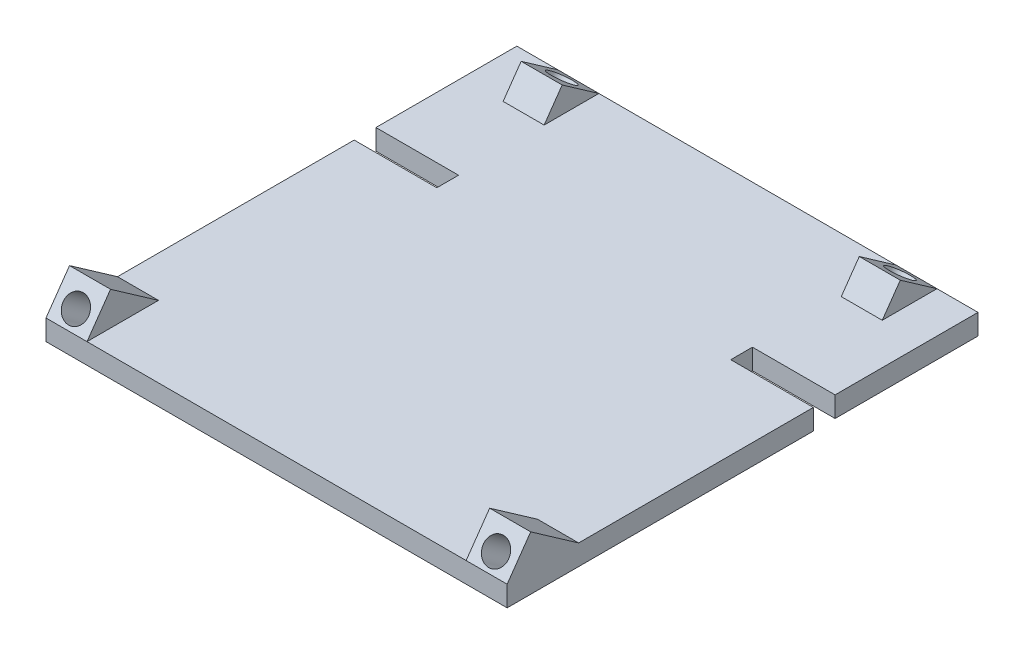
ISO-10303-21;
HEADER;
FILE_DESCRIPTION(('STEP AP214'),'2;1');
FILE_NAME('part.step','',(''),(''),'','','');
FILE_SCHEMA(('AUTOMOTIVE_DESIGN { 1 0 10303 214 1 1 1 1 }'));
ENDSEC;
DATA;
#1=APPLICATION_CONTEXT('core data for automotive mechanical design processes');
#2=APPLICATION_PROTOCOL_DEFINITION('international standard','automotive_design',2000,#1);
#3=PRODUCT_CONTEXT('',#1,'mechanical');
#4=PRODUCT('Part','Part','',(#3));
#5=PRODUCT_RELATED_PRODUCT_CATEGORY('part','',(#4));
#6=PRODUCT_DEFINITION_FORMATION('','',#4);
#7=PRODUCT_DEFINITION_CONTEXT('part definition',#1,'design');
#8=PRODUCT_DEFINITION('design','',#6,#7);
#9=PRODUCT_DEFINITION_SHAPE('','',#8);
#10=(LENGTH_UNIT() NAMED_UNIT(*) SI_UNIT(.MILLI.,.METRE.));
#11=(NAMED_UNIT(*) PLANE_ANGLE_UNIT() SI_UNIT($,.RADIAN.));
#12=(NAMED_UNIT(*) SI_UNIT($,.STERADIAN.) SOLID_ANGLE_UNIT());
#13=UNCERTAINTY_MEASURE_WITH_UNIT(LENGTH_MEASURE(1.E-05),#10,'distance_accuracy_value','');
#14=(GEOMETRIC_REPRESENTATION_CONTEXT(3) GLOBAL_UNCERTAINTY_ASSIGNED_CONTEXT((#13)) GLOBAL_UNIT_ASSIGNED_CONTEXT((#10,
#11,#12)) REPRESENTATION_CONTEXT('',''));
#15=CARTESIAN_POINT('',(0.,0.,0.));
#16=DIRECTION('',(0.,0.,1.));
#17=DIRECTION('',(1.,0.,0.));
#18=AXIS2_PLACEMENT_3D('',#15,#16,#17);
#19=CARTESIAN_POINT('',(0.,36.4517386998749,0.));
#20=DIRECTION('',(0.,-1.,0.));
#21=DIRECTION('',(0.,0.,-1.));
#22=AXIS2_PLACEMENT_3D('',#19,#20,#21);
#23=PLANE('',#22);
#24=DIRECTION('',(0.,0.,1.));
#25=VECTOR('',#24,1.);
#26=CARTESIAN_POINT('',(-80.2666243987654,36.4517386998749,7.48223474989885));
#27=LINE('',#26,#25);
#28=CARTESIAN_POINT('',(-80.2666243987654,36.4517386998749,7.48223474989885));
#29=VERTEX_POINT('',#28);
#30=CARTESIAN_POINT('',(-80.2666243987654,36.4517386998749,24.9167027061099));
#31=VERTEX_POINT('',#30);
#32=EDGE_CURVE('E259',#29,#31,#27,.T.);
#33=ORIENTED_EDGE('',*,*,#32,.T.);
#34=DIRECTION('',(-1.,0.,0.));
#35=VECTOR('',#34,1.);
#36=CARTESIAN_POINT('',(22.1879607597597,36.4517386998749,24.91670270611));
#37=LINE('',#36,#35);
#38=CARTESIAN_POINT('',(12.1879607597597,36.4517386998749,24.91670270611));
#39=VERTEX_POINT('',#38);
#40=EDGE_CURVE('E200',#39,#31,#37,.T.);
#41=ORIENTED_EDGE('',*,*,#40,.F.);
#42=DIRECTION('',(0.,0.,1.));
#43=VECTOR('',#42,1.);
#44=CARTESIAN_POINT('',(12.1879607597597,36.4517386998749,7.48223474989886));
#45=LINE('',#44,#43);
#46=CARTESIAN_POINT('',(12.1879607597597,36.4517386998749,7.48223474989886));
#47=VERTEX_POINT('',#46);
#48=EDGE_CURVE('E318',#47,#39,#45,.T.);
#49=ORIENTED_EDGE('',*,*,#48,.F.);
#50=DIRECTION('',(1.,0.,0.));
#51=VECTOR('',#50,1.);
#52=CARTESIAN_POINT('',(12.1879607597597,36.4517386998749,7.48223474989886));
#53=LINE('',#52,#51);
#54=CARTESIAN_POINT('',(22.1879607597597,36.4517386998749,7.48223474989886));
#55=VERTEX_POINT('',#54);
#56=EDGE_CURVE('E309',#47,#55,#53,.T.);
#57=ORIENTED_EDGE('',*,*,#56,.T.);
#58=DIRECTION('',(0.,0.,1.));
#59=VECTOR('',#58,1.);
#60=CARTESIAN_POINT('',(22.1879607597597,36.4517386998749,0.));
#61=LINE('',#60,#59);
#62=CARTESIAN_POINT('',(22.1879607597597,36.4517386998749,-49.757339729889));
#63=VERTEX_POINT('',#62);
#64=EDGE_CURVE('E408',#63,#55,#61,.T.);
#65=ORIENTED_EDGE('',*,*,#64,.F.);
#66=DIRECTION('',(-1.,0.,0.));
#67=VECTOR('',#66,1.);
#68=CARTESIAN_POINT('',(0.,36.4517386998749,-49.757339729889));
#69=LINE('',#68,#67);
#70=CARTESIAN_POINT('',(2.03796075975966,36.4517386998749,-49.757339729889));
#71=VERTEX_POINT('',#70);
#72=EDGE_CURVE('E405',#63,#71,#69,.T.);
#73=ORIENTED_EDGE('',*,*,#72,.T.);
#74=DIRECTION('',(0.,0.,-1.));
#75=VECTOR('',#74,1.);
#76=CARTESIAN_POINT('',(2.03796075975966,36.4517386998749,0.));
#77=LINE('',#76,#75);
#78=CARTESIAN_POINT('',(2.03796075975966,36.4517386998749,-55.057339729889));
#79=VERTEX_POINT('',#78);
#80=EDGE_CURVE('E409',#71,#79,#77,.T.);
#81=ORIENTED_EDGE('',*,*,#80,.T.);
#82=DIRECTION('',(1.,0.,0.));
#83=VECTOR('',#82,1.);
#84=CARTESIAN_POINT('',(0.,36.4517386998749,-55.057339729889));
#85=LINE('',#84,#83);
#86=CARTESIAN_POINT('',(22.1879607597597,36.4517386998749,-55.057339729889));
#87=VERTEX_POINT('',#86);
#88=EDGE_CURVE('E412',#79,#87,#85,.T.);
#89=ORIENTED_EDGE('',*,*,#88,.T.);
#90=CARTESIAN_POINT('',(22.1879607597597,36.4517386998749,-89.907339729889));
#91=VERTEX_POINT('',#90);
#92=EDGE_CURVE('E415',#91,#87,#61,.T.);
#93=ORIENTED_EDGE('',*,*,#92,.F.);
#94=DIRECTION('',(-1.,0.,0.));
#95=VECTOR('',#94,1.);
#96=CARTESIAN_POINT('',(0.,36.4517386998749,-89.907339729889));
#97=LINE('',#96,#95);
#98=CARTESIAN_POINT('',(12.1879607597597,36.4517386998749,-89.907339729889));
#99=VERTEX_POINT('',#98);
#100=EDGE_CURVE('E418',#91,#99,#97,.T.);
#101=ORIENTED_EDGE('',*,*,#100,.T.);
#102=DIRECTION('',(0.,0.,-1.));
#103=VECTOR('',#102,1.);
#104=CARTESIAN_POINT('',(12.1879607597597,36.4517386998749,-76.5596766921129));
#105=LINE('',#104,#103);
#106=CARTESIAN_POINT('',(12.1879607597597,36.4517386998749,-76.5596766921129));
#107=VERTEX_POINT('',#106);
#108=EDGE_CURVE('E49',#107,#99,#105,.T.);
#109=ORIENTED_EDGE('',*,*,#108,.F.);
#110=DIRECTION('',(-1.,0.,0.));
#111=VECTOR('',#110,1.);
#112=CARTESIAN_POINT('',(12.1879607597597,36.4517386998749,-76.5596766921129));
#113=LINE('',#112,#111);
#114=CARTESIAN_POINT('',(2.18796075975966,36.4517386998749,-76.5596766921129));
#115=VERTEX_POINT('',#114);
#116=EDGE_CURVE('E54',#107,#115,#113,.T.);
#117=ORIENTED_EDGE('',*,*,#116,.T.);
#118=DIRECTION('',(0.,0.,-1.));
#119=VECTOR('',#118,1.);
#120=CARTESIAN_POINT('',(2.18796075975966,36.4517386998749,-76.5596766921129));
#121=LINE('',#120,#119);
#122=CARTESIAN_POINT('',(2.18796075975966,36.4517386998749,-89.907339729889));
#123=VERTEX_POINT('',#122);
#124=EDGE_CURVE('E344',#115,#123,#121,.T.);
#125=ORIENTED_EDGE('',*,*,#124,.T.);
#126=CARTESIAN_POINT('',(-70.2666243987654,36.4517386998749,-89.907339729889));
#127=VERTEX_POINT('',#126);
#128=EDGE_CURVE('E420',#123,#127,#97,.T.);
#129=ORIENTED_EDGE('',*,*,#128,.T.);
#130=DIRECTION('',(0.,0.,-1.));
#131=VECTOR('',#130,1.);
#132=CARTESIAN_POINT('',(-70.2666243987654,36.4517386998749,-76.5596766921129));
#133=LINE('',#132,#131);
#134=CARTESIAN_POINT('',(-70.2666243987654,36.4517386998749,-76.5596766921129));
#135=VERTEX_POINT('',#134);
#136=EDGE_CURVE('E292',#135,#127,#133,.T.);
#137=ORIENTED_EDGE('',*,*,#136,.F.);
#138=DIRECTION('',(1.,0.,0.));
#139=VECTOR('',#138,1.);
#140=CARTESIAN_POINT('',(-80.2666243987654,36.4517386998749,-76.5596766921129));
#141=LINE('',#140,#139);
#142=CARTESIAN_POINT('',(-80.2666243987654,36.4517386998749,-76.5596766921129));
#143=VERTEX_POINT('',#142);
#144=EDGE_CURVE('E276',#143,#135,#141,.T.);
#145=ORIENTED_EDGE('',*,*,#144,.F.);
#146=DIRECTION('',(0.,0.,-1.));
#147=VECTOR('',#146,1.);
#148=CARTESIAN_POINT('',(-80.2666243987654,36.4517386998749,-76.5596766921129));
#149=LINE('',#148,#147);
#150=CARTESIAN_POINT('',(-80.2666243987654,36.4517386998749,-89.907339729889));
#151=VERTEX_POINT('',#150);
#152=EDGE_CURVE('E288',#143,#151,#149,.T.);
#153=ORIENTED_EDGE('',*,*,#152,.T.);
#154=CARTESIAN_POINT('',(-90.2666243987654,36.4517386998749,-89.907339729889));
#155=VERTEX_POINT('',#154);
#156=EDGE_CURVE('E421',#151,#155,#97,.T.);
#157=ORIENTED_EDGE('',*,*,#156,.T.);
#158=DIRECTION('',(0.,0.,1.));
#159=VECTOR('',#158,1.);
#160=CARTESIAN_POINT('',(-90.2666243987654,36.4517386998749,0.));
#161=LINE('',#160,#159);
#162=CARTESIAN_POINT('',(-90.2666243987654,36.4517386998749,-55.5341879171155));
#163=VERTEX_POINT('',#162);
#164=EDGE_CURVE('E422',#155,#163,#161,.T.);
#165=ORIENTED_EDGE('',*,*,#164,.T.);
#166=DIRECTION('',(1.,0.,0.));
#167=VECTOR('',#166,1.);
#168=CARTESIAN_POINT('',(0.,36.4517386998749,-55.5341879171155));
#169=LINE('',#168,#167);
#170=CARTESIAN_POINT('',(-70.1166243987654,36.4517386998749,-55.5341879171155));
#171=VERTEX_POINT('',#170);
#172=EDGE_CURVE('E425',#163,#171,#169,.T.);
#173=ORIENTED_EDGE('',*,*,#172,.T.);
#174=DIRECTION('',(0.,0.,1.));
#175=VECTOR('',#174,1.);
#176=CARTESIAN_POINT('',(-70.1166243987654,36.4517386998749,0.));
#177=LINE('',#176,#175);
#178=CARTESIAN_POINT('',(-70.1166243987654,36.4517386998749,-50.2341879171155));
#179=VERTEX_POINT('',#178);
#180=EDGE_CURVE('E385',#171,#179,#177,.T.);
#181=ORIENTED_EDGE('',*,*,#180,.T.);
#182=DIRECTION('',(-1.,0.,0.));
#183=VECTOR('',#182,1.);
#184=CARTESIAN_POINT('',(0.,36.4517386998749,-50.2341879171155));
#185=LINE('',#184,#183);
#186=CARTESIAN_POINT('',(-90.2666243987654,36.4517386998749,-50.2341879171155));
#187=VERTEX_POINT('',#186);
#188=EDGE_CURVE('E255',#179,#187,#185,.T.);
#189=ORIENTED_EDGE('',*,*,#188,.T.);
#190=CARTESIAN_POINT('',(-90.2666243987654,36.4517386998749,7.48223474989885));
#191=VERTEX_POINT('',#190);
#192=EDGE_CURVE('E247',#187,#191,#161,.T.);
#193=ORIENTED_EDGE('',*,*,#192,.T.);
#194=DIRECTION('',(-1.,0.,0.));
#195=VECTOR('',#194,1.);
#196=CARTESIAN_POINT('',(-80.2666243987654,36.4517386998749,7.48223474989885));
#197=LINE('',#196,#195);
#198=EDGE_CURVE('E253',#29,#191,#197,.T.);
#199=ORIENTED_EDGE('',*,*,#198,.F.);
#200=EDGE_LOOP('',(#33,#41,#49,#57,#65,#73,#81,#89,#93,#101,#109,#117,#125,#129,#137,#145,#153,
#157,#165,#173,#181,#189,#193,#199));
#201=FACE_BOUND('',#200,.T.);
#202=ADVANCED_FACE('F34',(#201),#23,.F.);
#203=CARTESIAN_POINT('',(0.,31.4517386998749,-50.2341879171155));
#204=DIRECTION('',(0.,0.,-1.));
#205=DIRECTION('',(-1.,0.,0.));
#206=AXIS2_PLACEMENT_3D('',#203,#204,#205);
#207=PLANE('',#206);
#208=ORIENTED_EDGE('',*,*,#188,.F.);
#209=DIRECTION('',(0.,1.,0.));
#210=VECTOR('',#209,1.);
#211=CARTESIAN_POINT('',(-70.1166243987654,31.4517386998749,-50.2341879171155));
#212=LINE('',#211,#210);
#213=CARTESIAN_POINT('',(-70.1166243987654,31.4517386998749,-50.2341879171155));
#214=VERTEX_POINT('',#213);
#215=EDGE_CURVE('E11',#214,#179,#212,.T.);
#216=ORIENTED_EDGE('',*,*,#215,.F.);
#217=DIRECTION('',(-1.,0.,0.));
#218=VECTOR('',#217,1.);
#219=CARTESIAN_POINT('',(0.,31.4517386998749,-50.2341879171155));
#220=LINE('',#219,#218);
#221=CARTESIAN_POINT('',(-90.2666243987654,31.4517386998749,-50.2341879171155));
#222=VERTEX_POINT('',#221);
#223=EDGE_CURVE('E244',#214,#222,#220,.T.);
#224=ORIENTED_EDGE('',*,*,#223,.T.);
#225=DIRECTION('',(0.,1.,0.));
#226=VECTOR('',#225,1.);
#227=CARTESIAN_POINT('',(-90.2666243987654,31.4517386998749,-50.2341879171155));
#228=LINE('',#227,#226);
#229=EDGE_CURVE('E219',#222,#187,#228,.T.);
#230=ORIENTED_EDGE('',*,*,#229,.T.);
#231=EDGE_LOOP('',(#208,#216,#224,#230));
#232=FACE_BOUND('',#231,.T.);
#233=ADVANCED_FACE('F36',(#232),#207,.T.);
#234=CARTESIAN_POINT('',(-70.1166243987654,31.4517386998749,0.));
#235=DIRECTION('',(-1.,0.,0.));
#236=DIRECTION('',(0.,0.,1.));
#237=AXIS2_PLACEMENT_3D('',#234,#235,#236);
#238=PLANE('',#237);
#239=ORIENTED_EDGE('',*,*,#180,.F.);
#240=DIRECTION('',(0.,1.,0.));
#241=VECTOR('',#240,1.);
#242=CARTESIAN_POINT('',(-70.1166243987654,31.4517386998749,-55.5341879171155));
#243=LINE('',#242,#241);
#244=CARTESIAN_POINT('',(-70.1166243987654,31.4517386998749,-55.5341879171155));
#245=VERTEX_POINT('',#244);
#246=EDGE_CURVE('E42',#245,#171,#243,.T.);
#247=ORIENTED_EDGE('',*,*,#246,.F.);
#248=DIRECTION('',(0.,0.,1.));
#249=VECTOR('',#248,1.);
#250=CARTESIAN_POINT('',(-70.1166243987654,31.4517386998749,0.));
#251=LINE('',#250,#249);
#252=EDGE_CURVE('E241',#245,#214,#251,.T.);
#253=ORIENTED_EDGE('',*,*,#252,.T.);
#254=ORIENTED_EDGE('',*,*,#215,.T.);
#255=EDGE_LOOP('',(#239,#247,#253,#254));
#256=FACE_BOUND('',#255,.T.);
#257=ADVANCED_FACE('F382',(#256),#238,.T.);
#258=CARTESIAN_POINT('',(0.,31.4517386998749,-55.5341879171155));
#259=DIRECTION('',(0.,0.,1.));
#260=DIRECTION('',(1.,0.,0.));
#261=AXIS2_PLACEMENT_3D('',#258,#259,#260);
#262=PLANE('',#261);
#263=ORIENTED_EDGE('',*,*,#172,.F.);
#264=DIRECTION('',(0.,1.,0.));
#265=VECTOR('',#264,1.);
#266=CARTESIAN_POINT('',(-90.2666243987654,31.4517386998749,-55.5341879171155));
#267=LINE('',#266,#265);
#268=CARTESIAN_POINT('',(-90.2666243987654,31.4517386998749,-55.5341879171155));
#269=VERTEX_POINT('',#268);
#270=EDGE_CURVE('E389',#269,#163,#267,.T.);
#271=ORIENTED_EDGE('',*,*,#270,.F.);
#272=DIRECTION('',(1.,0.,0.));
#273=VECTOR('',#272,1.);
#274=CARTESIAN_POINT('',(0.,31.4517386998749,-55.5341879171155));
#275=LINE('',#274,#273);
#276=EDGE_CURVE('E237',#269,#245,#275,.T.);
#277=ORIENTED_EDGE('',*,*,#276,.T.);
#278=ORIENTED_EDGE('',*,*,#246,.T.);
#279=EDGE_LOOP('',(#263,#271,#277,#278));
#280=FACE_BOUND('',#279,.T.);
#281=ADVANCED_FACE('F485',(#280),#262,.T.);
#282=CARTESIAN_POINT('',(-90.2666243987654,31.4517386998749,0.));
#283=DIRECTION('',(-1.,0.,0.));
#284=DIRECTION('',(0.,0.,1.));
#285=AXIS2_PLACEMENT_3D('',#282,#283,#284);
#286=PLANE('',#285);
#287=ORIENTED_EDGE('',*,*,#164,.F.);
#288=DIRECTION('',(0.,1.,0.));
#289=VECTOR('',#288,1.);
#290=CARTESIAN_POINT('',(-90.2666243987654,31.4517386998749,-89.907339729889));
#291=LINE('',#290,#289);
#292=CARTESIAN_POINT('',(-90.2666243987654,31.4517386998749,-89.907339729889));
#293=VERTEX_POINT('',#292);
#294=EDGE_CURVE('E390',#293,#155,#291,.T.);
#295=ORIENTED_EDGE('',*,*,#294,.F.);
#296=DIRECTION('',(0.,0.,1.));
#297=VECTOR('',#296,1.);
#298=CARTESIAN_POINT('',(-90.2666243987654,31.4517386998749,0.));
#299=LINE('',#298,#297);
#300=EDGE_CURVE('E221',#293,#269,#299,.T.);
#301=ORIENTED_EDGE('',*,*,#300,.T.);
#302=ORIENTED_EDGE('',*,*,#270,.T.);
#303=EDGE_LOOP('',(#287,#295,#301,#302));
#304=FACE_BOUND('',#303,.T.);
#305=ADVANCED_FACE('F470',(#304),#286,.T.);
#306=CARTESIAN_POINT('',(0.,31.4517386998749,-89.907339729889));
#307=DIRECTION('',(0.,0.,-1.));
#308=DIRECTION('',(-1.,0.,0.));
#309=AXIS2_PLACEMENT_3D('',#306,#307,#308);
#310=PLANE('',#309);
#311=ORIENTED_EDGE('',*,*,#100,.F.);
#312=DIRECTION('',(0.,1.,0.));
#313=VECTOR('',#312,1.);
#314=CARTESIAN_POINT('',(22.1879607597597,31.4517386998749,-89.907339729889));
#315=LINE('',#314,#313);
#316=CARTESIAN_POINT('',(22.1879607597597,31.4517386998749,-89.907339729889));
#317=VERTEX_POINT('',#316);
#318=EDGE_CURVE('E394',#317,#91,#315,.T.);
#319=ORIENTED_EDGE('',*,*,#318,.F.);
#320=DIRECTION('',(-1.,0.,0.));
#321=VECTOR('',#320,1.);
#322=CARTESIAN_POINT('',(0.,31.4517386998749,-89.907339729889));
#323=LINE('',#322,#321);
#324=EDGE_CURVE('E227',#317,#293,#323,.T.);
#325=ORIENTED_EDGE('',*,*,#324,.T.);
#326=ORIENTED_EDGE('',*,*,#294,.T.);
#327=ORIENTED_EDGE('',*,*,#156,.F.);
#328=DIRECTION('',(1.,0.,0.));
#329=VECTOR('',#328,1.);
#330=CARTESIAN_POINT('',(-80.2666243987654,36.4517386998749,-89.907339729889));
#331=LINE('',#330,#329);
#332=EDGE_CURVE('E277',#151,#127,#331,.T.);
#333=ORIENTED_EDGE('',*,*,#332,.T.);
#334=ORIENTED_EDGE('',*,*,#128,.F.);
#335=DIRECTION('',(-1.,0.,0.));
#336=VECTOR('',#335,1.);
#337=CARTESIAN_POINT('',(12.1879607597597,36.4517386998749,-89.907339729889));
#338=LINE('',#337,#336);
#339=EDGE_CURVE('E332',#99,#123,#338,.T.);
#340=ORIENTED_EDGE('',*,*,#339,.F.);
#341=EDGE_LOOP('',(#311,#319,#325,#326,#327,#333,#334,#340));
#342=FACE_BOUND('',#341,.T.);
#343=ADVANCED_FACE('F482',(#342),#310,.T.);
#344=CARTESIAN_POINT('',(22.1879607597597,31.4517386998749,0.));
#345=DIRECTION('',(-1.,0.,0.));
#346=DIRECTION('',(0.,0.,1.));
#347=AXIS2_PLACEMENT_3D('',#344,#345,#346);
#348=PLANE('',#347);
#349=ORIENTED_EDGE('',*,*,#92,.T.);
#350=DIRECTION('',(0.,1.,0.));
#351=VECTOR('',#350,1.);
#352=CARTESIAN_POINT('',(22.1879607597597,31.4517386998749,-55.057339729889));
#353=LINE('',#352,#351);
#354=CARTESIAN_POINT('',(22.1879607597597,31.4517386998749,-55.057339729889));
#355=VERTEX_POINT('',#354);
#356=EDGE_CURVE('E396',#355,#87,#353,.T.);
#357=ORIENTED_EDGE('',*,*,#356,.F.);
#358=DIRECTION('',(0.,0.,1.));
#359=VECTOR('',#358,1.);
#360=CARTESIAN_POINT('',(22.1879607597597,31.4517386998749,0.));
#361=LINE('',#360,#359);
#362=EDGE_CURVE('E218',#317,#355,#361,.T.);
#363=ORIENTED_EDGE('',*,*,#362,.F.);
#364=ORIENTED_EDGE('',*,*,#318,.T.);
#365=EDGE_LOOP('',(#349,#357,#363,#364));
#366=FACE_BOUND('',#365,.T.);
#367=ADVANCED_FACE('F473',(#366),#348,.F.);
#368=CARTESIAN_POINT('',(0.,31.4517386998749,-55.057339729889));
#369=DIRECTION('',(0.,0.,1.));
#370=DIRECTION('',(1.,0.,0.));
#371=AXIS2_PLACEMENT_3D('',#368,#369,#370);
#372=PLANE('',#371);
#373=ORIENTED_EDGE('',*,*,#88,.F.);
#374=DIRECTION('',(0.,1.,0.));
#375=VECTOR('',#374,1.);
#376=CARTESIAN_POINT('',(2.03796075975966,31.4517386998749,-55.057339729889));
#377=LINE('',#376,#375);
#378=CARTESIAN_POINT('',(2.03796075975966,31.4517386998749,-55.057339729889));
#379=VERTEX_POINT('',#378);
#380=EDGE_CURVE('E398',#379,#79,#377,.T.);
#381=ORIENTED_EDGE('',*,*,#380,.F.);
#382=DIRECTION('',(1.,0.,0.));
#383=VECTOR('',#382,1.);
#384=CARTESIAN_POINT('',(0.,31.4517386998749,-55.057339729889));
#385=LINE('',#384,#383);
#386=EDGE_CURVE('E226',#379,#355,#385,.T.);
#387=ORIENTED_EDGE('',*,*,#386,.T.);
#388=ORIENTED_EDGE('',*,*,#356,.T.);
#389=EDGE_LOOP('',(#373,#381,#387,#388));
#390=FACE_BOUND('',#389,.T.);
#391=ADVANCED_FACE('F478',(#390),#372,.T.);
#392=CARTESIAN_POINT('',(2.03796075975966,31.4517386998749,0.));
#393=DIRECTION('',(1.,0.,0.));
#394=DIRECTION('',(0.,0.,-1.));
#395=AXIS2_PLACEMENT_3D('',#392,#393,#394);
#396=PLANE('',#395);
#397=ORIENTED_EDGE('',*,*,#80,.F.);
#398=DIRECTION('',(0.,1.,0.));
#399=VECTOR('',#398,1.);
#400=CARTESIAN_POINT('',(2.03796075975966,31.4517386998749,-49.757339729889));
#401=LINE('',#400,#399);
#402=CARTESIAN_POINT('',(2.03796075975966,31.4517386998749,-49.757339729889));
#403=VERTEX_POINT('',#402);
#404=EDGE_CURVE('E400',#403,#71,#401,.T.);
#405=ORIENTED_EDGE('',*,*,#404,.F.);
#406=DIRECTION('',(0.,0.,-1.));
#407=VECTOR('',#406,1.);
#408=CARTESIAN_POINT('',(2.03796075975966,31.4517386998749,0.));
#409=LINE('',#408,#407);
#410=EDGE_CURVE('E222',#403,#379,#409,.T.);
#411=ORIENTED_EDGE('',*,*,#410,.T.);
#412=ORIENTED_EDGE('',*,*,#380,.T.);
#413=EDGE_LOOP('',(#397,#405,#411,#412));
#414=FACE_BOUND('',#413,.T.);
#415=ADVANCED_FACE('F432',(#414),#396,.T.);
#416=CARTESIAN_POINT('',(0.,31.4517386998749,-49.757339729889));
#417=DIRECTION('',(0.,0.,-1.));
#418=DIRECTION('',(-1.,0.,0.));
#419=AXIS2_PLACEMENT_3D('',#416,#417,#418);
#420=PLANE('',#419);
#421=ORIENTED_EDGE('',*,*,#72,.F.);
#422=DIRECTION('',(0.,1.,0.));
#423=VECTOR('',#422,1.);
#424=CARTESIAN_POINT('',(22.1879607597597,31.4517386998749,-49.757339729889));
#425=LINE('',#424,#423);
#426=CARTESIAN_POINT('',(22.1879607597597,31.4517386998749,-49.757339729889));
#427=VERTEX_POINT('',#426);
#428=EDGE_CURVE('E402',#427,#63,#425,.T.);
#429=ORIENTED_EDGE('',*,*,#428,.F.);
#430=DIRECTION('',(-1.,0.,0.));
#431=VECTOR('',#430,1.);
#432=CARTESIAN_POINT('',(0.,31.4517386998749,-49.757339729889));
#433=LINE('',#432,#431);
#434=EDGE_CURVE('E215',#427,#403,#433,.T.);
#435=ORIENTED_EDGE('',*,*,#434,.T.);
#436=ORIENTED_EDGE('',*,*,#404,.T.);
#437=EDGE_LOOP('',(#421,#429,#435,#436));
#438=FACE_BOUND('',#437,.T.);
#439=ADVANCED_FACE('F436',(#438),#420,.T.);
#440=DIRECTION('',(0.,0.819152044288996,-0.573576436351039));
#441=VECTOR('',#440,1.);
#442=CARTESIAN_POINT('',(22.1879607597597,44.6432591427648,19.1809383425996));
#443=LINE('',#442,#441);
#444=CARTESIAN_POINT('',(22.1879607597597,36.4517386998749,24.91670270611));
#445=VERTEX_POINT('',#444);
#446=CARTESIAN_POINT('',(22.1879607597597,44.6432591427648,19.1809383425996));
#447=VERTEX_POINT('',#446);
#448=EDGE_CURVE('E209',#445,#447,#443,.T.);
#449=ORIENTED_EDGE('',*,*,#448,.F.);
#450=DIRECTION('',(0.,-1.,0.));
#451=VECTOR('',#450,1.);
#452=CARTESIAN_POINT('',(22.1879607597597,0.,24.9167027061099));
#453=LINE('',#452,#451);
#454=CARTESIAN_POINT('',(22.1879607597597,31.4517386998749,24.91670270611));
#455=VERTEX_POINT('',#454);
#456=EDGE_CURVE('E191',#445,#455,#453,.T.);
#457=ORIENTED_EDGE('',*,*,#456,.T.);
#458=EDGE_CURVE('E206',#427,#455,#361,.T.);
#459=ORIENTED_EDGE('',*,*,#458,.F.);
#460=ORIENTED_EDGE('',*,*,#428,.T.);
#461=ORIENTED_EDGE('',*,*,#64,.T.);
#462=DIRECTION('',(0.,-0.573576436351041,-0.819152044288995));
#463=VECTOR('',#462,1.);
#464=CARTESIAN_POINT('',(22.1879607597597,36.4517386998749,7.48223474989886));
#465=LINE('',#464,#463);
#466=EDGE_CURVE('E319',#447,#55,#465,.T.);
#467=ORIENTED_EDGE('',*,*,#466,.F.);
#468=EDGE_LOOP('',(#449,#457,#459,#460,#461,#467));
#469=FACE_BOUND('',#468,.T.);
#470=ADVANCED_FACE('F205',(#469),#348,.F.);
#471=DIRECTION('',(0.,-1.,0.));
#472=VECTOR('',#471,1.);
#473=CARTESIAN_POINT('',(-90.2666243987654,0.,24.9167027061099));
#474=LINE('',#473,#472);
#475=CARTESIAN_POINT('',(-90.2666243987654,36.4517386998749,24.9167027061099));
#476=VERTEX_POINT('',#475);
#477=CARTESIAN_POINT('',(-90.2666243987654,31.4517386998749,24.9167027061099));
#478=VERTEX_POINT('',#477);
#479=EDGE_CURVE('E194',#476,#478,#474,.T.);
#480=ORIENTED_EDGE('',*,*,#479,.F.);
#481=DIRECTION('',(0.,0.819152044288996,-0.573576436351039));
#482=VECTOR('',#481,1.);
#483=CARTESIAN_POINT('',(-90.2666243987654,44.6432591427648,19.1809383425996));
#484=LINE('',#483,#482);
#485=CARTESIAN_POINT('',(-90.2666243987654,44.6432591427648,19.1809383425996));
#486=VERTEX_POINT('',#485);
#487=EDGE_CURVE('E260',#476,#486,#484,.T.);
#488=ORIENTED_EDGE('',*,*,#487,.T.);
#489=DIRECTION('',(0.,-0.573576436351041,-0.819152044288995));
#490=VECTOR('',#489,1.);
#491=CARTESIAN_POINT('',(-90.2666243987654,36.4517386998749,7.48223474989885));
#492=LINE('',#491,#490);
#493=EDGE_CURVE('E256',#486,#191,#492,.T.);
#494=ORIENTED_EDGE('',*,*,#493,.T.);
#495=ORIENTED_EDGE('',*,*,#192,.F.);
#496=ORIENTED_EDGE('',*,*,#229,.F.);
#497=EDGE_CURVE('E216',#222,#478,#299,.T.);
#498=ORIENTED_EDGE('',*,*,#497,.T.);
#499=EDGE_LOOP('',(#480,#488,#494,#495,#496,#498));
#500=FACE_BOUND('',#499,.T.);
#501=ADVANCED_FACE('F375',(#500),#286,.T.);
#502=CARTESIAN_POINT('',(0.,31.4517386998749,0.));
#503=DIRECTION('',(0.,-1.,0.));
#504=DIRECTION('',(0.,0.,-1.));
#505=AXIS2_PLACEMENT_3D('',#502,#503,#504);
#506=PLANE('',#505);
#507=DIRECTION('',(-1.,0.,0.));
#508=VECTOR('',#507,1.);
#509=CARTESIAN_POINT('',(22.1879607597597,31.4517386998749,24.91670270611));
#510=LINE('',#509,#508);
#511=EDGE_CURVE('E188',#455,#478,#510,.T.);
#512=ORIENTED_EDGE('',*,*,#511,.T.);
#513=ORIENTED_EDGE('',*,*,#497,.F.);
#514=ORIENTED_EDGE('',*,*,#223,.F.);
#515=ORIENTED_EDGE('',*,*,#252,.F.);
#516=ORIENTED_EDGE('',*,*,#276,.F.);
#517=ORIENTED_EDGE('',*,*,#300,.F.);
#518=ORIENTED_EDGE('',*,*,#324,.F.);
#519=ORIENTED_EDGE('',*,*,#362,.T.);
#520=ORIENTED_EDGE('',*,*,#386,.F.);
#521=ORIENTED_EDGE('',*,*,#410,.F.);
#522=ORIENTED_EDGE('',*,*,#434,.F.);
#523=ORIENTED_EDGE('',*,*,#458,.T.);
#524=EDGE_LOOP('',(#512,#513,#514,#515,#516,#517,#518,#519,#520,#521,#522,#523));
#525=FACE_BOUND('',#524,.T.);
#526=CARTESIAN_POINT('',(7.18796075975966,31.4517386998749,-80.3832865336332));
#527=DIRECTION('',(0.,-1.,0.));
#528=DIRECTION('',(0.,0.,-1.));
#529=AXIS2_PLACEMENT_3D('',#526,#527,#528);
#530=ELLIPSE('',#529,3.7844012251605,3.1);
#531=CARTESIAN_POINT('',(7.18796075975967,31.4517386998749,-84.1676877587937));
#532=VERTEX_POINT('',#531);
#533=EDGE_CURVE('E346',#532,#532,#530,.F.);
#534=ORIENTED_EDGE('',*,*,#533,.T.);
#535=EDGE_LOOP('',(#534));
#536=FACE_BOUND('',#535,.T.);
#537=CARTESIAN_POINT('',(17.1879607597597,31.4517386998749,10.8021754899151));
#538=DIRECTION('',(0.,-1.,0.));
#539=DIRECTION('',(0.,0.,1.));
#540=AXIS2_PLACEMENT_3D('',#537,#538,#539);
#541=ELLIPSE('',#540,5.40468506642564,3.10000000000009);
#542=CARTESIAN_POINT('',(17.1879607597597,31.4517386998749,16.2068605563408));
#543=VERTEX_POINT('',#542);
#544=EDGE_CURVE('E321',#543,#543,#541,.F.);
#545=ORIENTED_EDGE('',*,*,#544,.T.);
#546=EDGE_LOOP('',(#545));
#547=FACE_BOUND('',#546,.T.);
#548=CARTESIAN_POINT('',(-75.2666243987654,31.4517386998749,-80.3832865336332));
#549=DIRECTION('',(0.,-1.,0.));
#550=DIRECTION('',(0.,0.,-1.));
#551=AXIS2_PLACEMENT_3D('',#548,#549,#550);
#552=ELLIPSE('',#551,3.7844012251605,3.1);
#553=CARTESIAN_POINT('',(-75.2666243987654,31.4517386998749,-84.1676877587937));
#554=VERTEX_POINT('',#553);
#555=EDGE_CURVE('E295',#554,#554,#552,.T.);
#556=ORIENTED_EDGE('',*,*,#555,.F.);
#557=EDGE_LOOP('',(#556));
#558=FACE_BOUND('',#557,.T.);
#559=CARTESIAN_POINT('',(-85.2666243987654,31.4517386998749,10.8021754899151));
#560=DIRECTION('',(0.,-1.,0.));
#561=DIRECTION('',(0.,0.,1.));
#562=AXIS2_PLACEMENT_3D('',#559,#560,#561);
#563=ELLIPSE('',#562,5.40468506642564,3.10000000000009);
#564=CARTESIAN_POINT('',(-85.2666243987654,31.4517386998749,16.2068605563408));
#565=VERTEX_POINT('',#564);
#566=EDGE_CURVE('E263',#565,#565,#563,.T.);
#567=ORIENTED_EDGE('',*,*,#566,.F.);
#568=EDGE_LOOP('',(#567));
#569=FACE_BOUND('',#568,.T.);
#570=ADVANCED_FACE('F211',(#525,#536,#547,#558,#569),#506,.T.);
#571=CARTESIAN_POINT('',(-80.2666243987654,36.4517386998749,7.48223474989885));
#572=DIRECTION('',(0.,0.819152044288995,-0.573576436351041));
#573=DIRECTION('',(0.,0.573576436351041,0.819152044288995));
#574=AXIS2_PLACEMENT_3D('',#571,#572,#573);
#575=PLANE('',#574);
#576=ORIENTED_EDGE('',*,*,#493,.F.);
#577=DIRECTION('',(-1.,0.,0.));
#578=VECTOR('',#577,1.);
#579=CARTESIAN_POINT('',(-80.2666243987654,44.6432591427648,19.1809383425996));
#580=LINE('',#579,#578);
#581=CARTESIAN_POINT('',(-80.2666243987654,44.6432591427648,19.1809383425996));
#582=VERTEX_POINT('',#581);
#583=EDGE_CURVE('E250',#582,#486,#580,.T.);
#584=ORIENTED_EDGE('',*,*,#583,.F.);
#585=DIRECTION('',(0.,-0.573576436351041,-0.819152044288995));
#586=VECTOR('',#585,1.);
#587=CARTESIAN_POINT('',(-80.2666243987654,36.4517386998749,7.48223474989885));
#588=LINE('',#587,#586);
#589=EDGE_CURVE('E251',#582,#29,#588,.T.);
#590=ORIENTED_EDGE('',*,*,#589,.T.);
#591=ORIENTED_EDGE('',*,*,#198,.T.);
#592=EDGE_LOOP('',(#576,#584,#590,#591));
#593=FACE_BOUND('',#592,.T.);
#594=ADVANCED_FACE('F373',(#593),#575,.T.);
#595=CARTESIAN_POINT('',(-80.2666243987654,44.6432591427648,19.1809383425996));
#596=DIRECTION('',(0.,0.573576436351039,0.819152044288996));
#597=DIRECTION('',(0.,-0.819152044288996,0.573576436351039));
#598=AXIS2_PLACEMENT_3D('',#595,#596,#597);
#599=PLANE('',#598);
#600=CARTESIAN_POINT('',(-85.2666243987654,39.7283468770307,22.622396960706));
#601=DIRECTION('',(0.,0.573576436351038,0.819152044288998));
#602=DIRECTION('',(0.,-0.819152044288998,0.573576436351038));
#603=AXIS2_PLACEMENT_3D('',#600,#601,#602);
#604=CIRCLE('',#603,3.10000000000009);
#605=CARTESIAN_POINT('',(-85.2666243987654,37.1889755397348,24.4004839133942));
#606=VERTEX_POINT('',#605);
#607=EDGE_CURVE('E273',#606,#606,#604,.T.);
#608=ORIENTED_EDGE('',*,*,#607,.F.);
#609=EDGE_LOOP('',(#608));
#610=FACE_BOUND('',#609,.T.);
#611=ORIENTED_EDGE('',*,*,#487,.F.);
#612=DIRECTION('',(-1.,0.,0.));
#613=VECTOR('',#612,1.);
#614=CARTESIAN_POINT('',(-80.2666243987654,36.4517386998749,24.91670270611));
#615=LINE('',#614,#613);
#616=EDGE_CURVE('E248',#31,#476,#615,.T.);
#617=ORIENTED_EDGE('',*,*,#616,.F.);
#618=DIRECTION('',(0.,0.819152044288996,-0.573576436351039));
#619=VECTOR('',#618,1.);
#620=CARTESIAN_POINT('',(-80.2666243987654,44.6432591427648,19.1809383425996));
#621=LINE('',#620,#619);
#622=EDGE_CURVE('E266',#31,#582,#621,.T.);
#623=ORIENTED_EDGE('',*,*,#622,.T.);
#624=ORIENTED_EDGE('',*,*,#583,.T.);
#625=EDGE_LOOP('',(#611,#617,#623,#624));
#626=FACE_BOUND('',#625,.T.);
#627=ADVANCED_FACE('F363',(#610,#626),#599,.T.);
#628=CARTESIAN_POINT('',(-80.2666243987654,0.,0.));
#629=DIRECTION('',(1.,0.,0.));
#630=DIRECTION('',(0.,0.,-1.));
#631=AXIS2_PLACEMENT_3D('',#628,#629,#630);
#632=PLANE('',#631);
#633=ORIENTED_EDGE('',*,*,#32,.F.);
#634=ORIENTED_EDGE('',*,*,#589,.F.);
#635=ORIENTED_EDGE('',*,*,#622,.F.);
#636=EDGE_LOOP('',(#633,#634,#635));
#637=FACE_BOUND('',#636,.T.);
#638=ADVANCED_FACE('F366',(#637),#632,.T.);
#639=CARTESIAN_POINT('',(-85.2666243987654,-15.8662554476128,-56.7749235348559));
#640=DIRECTION('',(0.,0.573576436351038,0.819152044288998));
#641=DIRECTION('',(0.,-0.819152044288998,0.573576436351038));
#642=AXIS2_PLACEMENT_3D('',#639,#640,#641);
#643=CYLINDRICAL_SURFACE('',#642,3.10000000000009);
#644=ORIENTED_EDGE('',*,*,#566,.T.);
#645=EDGE_LOOP('',(#644));
#646=FACE_BOUND('',#645,.T.);
#647=ORIENTED_EDGE('',*,*,#607,.T.);
#648=EDGE_LOOP('',(#647));
#649=FACE_BOUND('',#648,.T.);
#650=ADVANCED_FACE('F558',(#646,#649),#643,.F.);
#651=CARTESIAN_POINT('',(-80.2666243987654,36.4517386998749,-76.5596766921129));
#652=DIRECTION('',(0.,0.573576436351039,0.819152044288997));
#653=DIRECTION('',(0.,-0.819152044288997,0.573576436351039));
#654=AXIS2_PLACEMENT_3D('',#651,#652,#653);
#655=PLANE('',#654);
#656=DIRECTION('',(0.,-0.819152044288997,0.573576436351039));
#657=VECTOR('',#656,1.);
#658=CARTESIAN_POINT('',(-70.2666243987654,36.4517386998749,-76.5596766921129));
#659=LINE('',#658,#657);
#660=CARTESIAN_POINT('',(-70.2666243987654,42.7230889305423,-80.9509233983794));
#661=VERTEX_POINT('',#660);
#662=EDGE_CURVE('E285',#661,#135,#659,.T.);
#663=ORIENTED_EDGE('',*,*,#662,.F.);
#664=DIRECTION('',(1.,0.,0.));
#665=VECTOR('',#664,1.);
#666=CARTESIAN_POINT('',(-80.2666243987654,42.7230889305423,-80.9509233983794));
#667=LINE('',#666,#665);
#668=CARTESIAN_POINT('',(-80.2666243987654,42.7230889305423,-80.9509233983794));
#669=VERTEX_POINT('',#668);
#670=EDGE_CURVE('E280',#669,#661,#667,.T.);
#671=ORIENTED_EDGE('',*,*,#670,.F.);
#672=DIRECTION('',(0.,-0.819152044288997,0.573576436351039));
#673=VECTOR('',#672,1.);
#674=CARTESIAN_POINT('',(-80.2666243987654,36.4517386998749,-76.5596766921129));
#675=LINE('',#674,#673);
#676=EDGE_CURVE('E281',#669,#143,#675,.T.);
#677=ORIENTED_EDGE('',*,*,#676,.T.);
#678=ORIENTED_EDGE('',*,*,#144,.T.);
#679=EDGE_LOOP('',(#663,#671,#677,#678));
#680=FACE_BOUND('',#679,.T.);
#681=ADVANCED_FACE('F565',(#680),#655,.T.);
#682=CARTESIAN_POINT('',(-80.2666243987654,42.7230889305423,-80.9509233983794));
#683=DIRECTION('',(0.,0.819152044288996,-0.57357643635104));
#684=DIRECTION('',(0.,0.57357643635104,0.819152044288996));
#685=AXIS2_PLACEMENT_3D('',#682,#683,#684);
#686=PLANE('',#685);
#687=CARTESIAN_POINT('',(-75.2666243987654,39.2816303124361,-85.8658356641134));
#688=DIRECTION('',(0.,0.819152044288995,-0.573576436351041));
#689=DIRECTION('',(0.,0.573576436351041,0.819152044288996));
#690=AXIS2_PLACEMENT_3D('',#687,#688,#689);
#691=CIRCLE('',#690,3.1);
#692=CARTESIAN_POINT('',(-75.2666243987654,41.0597172651243,-83.3264643268175));
#693=VERTEX_POINT('',#692);
#694=EDGE_CURVE('E305',#693,#693,#691,.T.);
#695=ORIENTED_EDGE('',*,*,#694,.F.);
#696=EDGE_LOOP('',(#695));
#697=FACE_BOUND('',#696,.T.);
#698=DIRECTION('',(0.,0.57357643635104,0.819152044288996));
#699=VECTOR('',#698,1.);
#700=CARTESIAN_POINT('',(-70.2666243987654,42.7230889305423,-80.9509233983794));
#701=LINE('',#700,#699);
#702=EDGE_CURVE('E289',#127,#661,#701,.T.);
#703=ORIENTED_EDGE('',*,*,#702,.F.);
#704=ORIENTED_EDGE('',*,*,#332,.F.);
#705=DIRECTION('',(0.,0.57357643635104,0.819152044288996));
#706=VECTOR('',#705,1.);
#707=CARTESIAN_POINT('',(-80.2666243987654,42.7230889305423,-80.9509233983794));
#708=LINE('',#707,#706);
#709=EDGE_CURVE('E298',#151,#669,#708,.T.);
#710=ORIENTED_EDGE('',*,*,#709,.T.);
#711=ORIENTED_EDGE('',*,*,#670,.T.);
#712=EDGE_LOOP('',(#703,#704,#710,#711));
#713=FACE_BOUND('',#712,.T.);
#714=ADVANCED_FACE('F573',(#697,#713),#686,.T.);
#715=CARTESIAN_POINT('',(-80.2666243987654,0.,0.));
#716=DIRECTION('',(1.,0.,0.));
#717=DIRECTION('',(0.,0.,-1.));
#718=AXIS2_PLACEMENT_3D('',#715,#716,#717);
#719=PLANE('',#718);
#720=ORIENTED_EDGE('',*,*,#152,.F.);
#721=ORIENTED_EDGE('',*,*,#676,.F.);
#722=ORIENTED_EDGE('',*,*,#709,.F.);
#723=EDGE_LOOP('',(#720,#721,#722));
#724=FACE_BOUND('',#723,.T.);
#725=ADVANCED_FACE('F582',(#724),#719,.F.);
#726=CARTESIAN_POINT('',(-70.2666243987654,0.,0.));
#727=DIRECTION('',(1.,0.,0.));
#728=DIRECTION('',(0.,0.,-1.));
#729=AXIS2_PLACEMENT_3D('',#726,#727,#728);
#730=PLANE('',#729);
#731=ORIENTED_EDGE('',*,*,#136,.T.);
#732=ORIENTED_EDGE('',*,*,#702,.T.);
#733=ORIENTED_EDGE('',*,*,#662,.T.);
#734=EDGE_LOOP('',(#731,#732,#733));
#735=FACE_BOUND('',#734,.T.);
#736=ADVANCED_FACE('F590',(#735),#730,.T.);
#737=CARTESIAN_POINT('',(-75.2666243987654,-20.4549772930323,-44.0378127116895));
#738=DIRECTION('',(0.,0.819152044288996,-0.573576436351041));
#739=DIRECTION('',(0.,0.573576436351041,0.819152044288996));
#740=AXIS2_PLACEMENT_3D('',#737,#738,#739);
#741=CYLINDRICAL_SURFACE('',#740,3.1);
#742=ORIENTED_EDGE('',*,*,#555,.T.);
#743=EDGE_LOOP('',(#742));
#744=FACE_BOUND('',#743,.T.);
#745=ORIENTED_EDGE('',*,*,#694,.T.);
#746=EDGE_LOOP('',(#745));
#747=FACE_BOUND('',#746,.T.);
#748=ADVANCED_FACE('F597',(#744,#747),#741,.F.);
#749=CARTESIAN_POINT('',(12.1879607597597,44.6432591427648,19.1809383425996));
#750=DIRECTION('',(0.,-0.573576436351039,-0.819152044288996));
#751=DIRECTION('',(0.,0.819152044288996,-0.573576436351039));
#752=AXIS2_PLACEMENT_3D('',#749,#750,#751);
#753=PLANE('',#752);
#754=CARTESIAN_POINT('',(17.1879607597597,39.7283468770307,22.622396960706));
#755=DIRECTION('',(0.,-0.573576436351038,-0.819152044288998));
#756=DIRECTION('',(0.,-0.819152044288998,0.573576436351038));
#757=AXIS2_PLACEMENT_3D('',#754,#755,#756);
#758=CIRCLE('',#757,3.10000000000009);
#759=CARTESIAN_POINT('',(17.1879607597597,37.1889755397348,24.4004839133942));
#760=VERTEX_POINT('',#759);
#761=EDGE_CURVE('E329',#760,#760,#758,.T.);
#762=ORIENTED_EDGE('',*,*,#761,.T.);
#763=EDGE_LOOP('',(#762));
#764=FACE_BOUND('',#763,.T.);
#765=ORIENTED_EDGE('',*,*,#448,.T.);
#766=DIRECTION('',(1.,0.,0.));
#767=VECTOR('',#766,1.);
#768=CARTESIAN_POINT('',(12.1879607597597,44.6432591427648,19.1809383425996));
#769=LINE('',#768,#767);
#770=CARTESIAN_POINT('',(12.1879607597597,44.6432591427648,19.1809383425996));
#771=VERTEX_POINT('',#770);
#772=EDGE_CURVE('E312',#771,#447,#769,.T.);
#773=ORIENTED_EDGE('',*,*,#772,.F.);
#774=DIRECTION('',(0.,0.819152044288996,-0.573576436351039));
#775=VECTOR('',#774,1.);
#776=CARTESIAN_POINT('',(12.1879607597597,44.6432591427648,19.1809383425996));
#777=LINE('',#776,#775);
#778=EDGE_CURVE('E313',#39,#771,#777,.T.);
#779=ORIENTED_EDGE('',*,*,#778,.F.);
#780=DIRECTION('',(1.,0.,0.));
#781=VECTOR('',#780,1.);
#782=CARTESIAN_POINT('',(12.1879607597597,36.4517386998749,24.91670270611));
#783=LINE('',#782,#781);
#784=EDGE_CURVE('E308',#39,#445,#783,.T.);
#785=ORIENTED_EDGE('',*,*,#784,.T.);
#786=EDGE_LOOP('',(#765,#773,#779,#785));
#787=FACE_BOUND('',#786,.T.);
#788=ADVANCED_FACE('F445',(#764,#787),#753,.F.);
#789=CARTESIAN_POINT('',(12.1879607597597,36.4517386998749,7.48223474989886));
#790=DIRECTION('',(0.,-0.819152044288995,0.573576436351041));
#791=DIRECTION('',(0.,-0.573576436351041,-0.819152044288995));
#792=AXIS2_PLACEMENT_3D('',#789,#790,#791);
#793=PLANE('',#792);
#794=ORIENTED_EDGE('',*,*,#466,.T.);
#795=ORIENTED_EDGE('',*,*,#56,.F.);
#796=DIRECTION('',(0.,-0.573576436351041,-0.819152044288995));
#797=VECTOR('',#796,1.);
#798=CARTESIAN_POINT('',(12.1879607597597,36.4517386998749,7.48223474989886));
#799=LINE('',#798,#797);
#800=EDGE_CURVE('E323',#771,#47,#799,.T.);
#801=ORIENTED_EDGE('',*,*,#800,.F.);
#802=ORIENTED_EDGE('',*,*,#772,.T.);
#803=EDGE_LOOP('',(#794,#795,#801,#802));
#804=FACE_BOUND('',#803,.T.);
#805=ADVANCED_FACE('F442',(#804),#793,.F.);
#806=CARTESIAN_POINT('',(12.1879607597597,0.,0.));
#807=DIRECTION('',(-1.,0.,0.));
#808=DIRECTION('',(0.,0.,-1.));
#809=AXIS2_PLACEMENT_3D('',#806,#807,#808);
#810=PLANE('',#809);
#811=ORIENTED_EDGE('',*,*,#48,.T.);
#812=ORIENTED_EDGE('',*,*,#778,.T.);
#813=ORIENTED_EDGE('',*,*,#800,.T.);
#814=EDGE_LOOP('',(#811,#812,#813));
#815=FACE_BOUND('',#814,.T.);
#816=ADVANCED_FACE('F447',(#815),#810,.T.);
#817=CARTESIAN_POINT('',(17.1879607597597,-15.8662554476128,-56.7749235348559));
#818=DIRECTION('',(0.,0.573576436351038,0.819152044288998));
#819=DIRECTION('',(0.,-0.819152044288998,0.573576436351038));
#820=AXIS2_PLACEMENT_3D('',#817,#818,#819);
#821=CYLINDRICAL_SURFACE('',#820,3.10000000000009);
#822=ORIENTED_EDGE('',*,*,#544,.F.);
#823=EDGE_LOOP('',(#822));
#824=FACE_BOUND('',#823,.T.);
#825=ORIENTED_EDGE('',*,*,#761,.F.);
#826=EDGE_LOOP('',(#825));
#827=FACE_BOUND('',#826,.T.);
#828=ADVANCED_FACE('F449',(#824,#827),#821,.F.);
#829=CARTESIAN_POINT('',(12.1879607597597,42.7230889305423,-80.9509233983794));
#830=DIRECTION('',(0.,-0.819152044288996,0.57357643635104));
#831=DIRECTION('',(0.,-0.57357643635104,-0.819152044288996));
#832=AXIS2_PLACEMENT_3D('',#829,#830,#831);
#833=PLANE('',#832);
#834=CARTESIAN_POINT('',(7.18796075975967,39.2816303124361,-85.8658356641134));
#835=DIRECTION('',(0.,-0.819152044288995,0.573576436351041));
#836=DIRECTION('',(0.,0.573576436351041,0.819152044288996));
#837=AXIS2_PLACEMENT_3D('',#834,#835,#836);
#838=CIRCLE('',#837,3.1);
#839=CARTESIAN_POINT('',(7.18796075975966,41.0597172651243,-83.3264643268175));
#840=VERTEX_POINT('',#839);
#841=EDGE_CURVE('E199',#840,#840,#838,.T.);
#842=ORIENTED_EDGE('',*,*,#841,.T.);
#843=EDGE_LOOP('',(#842));
#844=FACE_BOUND('',#843,.T.);
#845=DIRECTION('',(0.,0.57357643635104,0.819152044288996));
#846=VECTOR('',#845,1.);
#847=CARTESIAN_POINT('',(2.18796075975966,42.7230889305423,-80.9509233983794));
#848=LINE('',#847,#846);
#849=CARTESIAN_POINT('',(2.18796075975966,42.7230889305423,-80.9509233983794));
#850=VERTEX_POINT('',#849);
#851=EDGE_CURVE('E340',#123,#850,#848,.T.);
#852=ORIENTED_EDGE('',*,*,#851,.T.);
#853=DIRECTION('',(-1.,0.,0.));
#854=VECTOR('',#853,1.);
#855=CARTESIAN_POINT('',(12.1879607597597,42.7230889305423,-80.9509233983794));
#856=LINE('',#855,#854);
#857=CARTESIAN_POINT('',(12.1879607597597,42.7230889305423,-80.9509233983794));
#858=VERTEX_POINT('',#857);
#859=EDGE_CURVE('E334',#858,#850,#856,.T.);
#860=ORIENTED_EDGE('',*,*,#859,.F.);
#861=DIRECTION('',(0.,0.57357643635104,0.819152044288996));
#862=VECTOR('',#861,1.);
#863=CARTESIAN_POINT('',(12.1879607597597,42.7230889305423,-80.9509233983794));
#864=LINE('',#863,#862);
#865=EDGE_CURVE('E335',#99,#858,#864,.T.);
#866=ORIENTED_EDGE('',*,*,#865,.F.);
#867=ORIENTED_EDGE('',*,*,#339,.T.);
#868=EDGE_LOOP('',(#852,#860,#866,#867));
#869=FACE_BOUND('',#868,.T.);
#870=ADVANCED_FACE('F455',(#844,#869),#833,.F.);
#871=CARTESIAN_POINT('',(12.1879607597597,36.4517386998749,-76.5596766921129));
#872=DIRECTION('',(0.,-0.573576436351039,-0.819152044288997));
#873=DIRECTION('',(0.,0.819152044288997,-0.573576436351039));
#874=AXIS2_PLACEMENT_3D('',#871,#872,#873);
#875=PLANE('',#874);
#876=DIRECTION('',(0.,-0.819152044288997,0.573576436351039));
#877=VECTOR('',#876,1.);
#878=CARTESIAN_POINT('',(2.18796075975966,36.4517386998749,-76.5596766921129));
#879=LINE('',#878,#877);
#880=EDGE_CURVE('E342',#850,#115,#879,.T.);
#881=ORIENTED_EDGE('',*,*,#880,.T.);
#882=ORIENTED_EDGE('',*,*,#116,.F.);
#883=DIRECTION('',(0.,-0.819152044288997,0.573576436351039));
#884=VECTOR('',#883,1.);
#885=CARTESIAN_POINT('',(12.1879607597597,36.4517386998749,-76.5596766921129));
#886=LINE('',#885,#884);
#887=EDGE_CURVE('E348',#858,#107,#886,.T.);
#888=ORIENTED_EDGE('',*,*,#887,.F.);
#889=ORIENTED_EDGE('',*,*,#859,.T.);
#890=EDGE_LOOP('',(#881,#882,#888,#889));
#891=FACE_BOUND('',#890,.T.);
#892=ADVANCED_FACE('F630',(#891),#875,.F.);
#893=CARTESIAN_POINT('',(12.1879607597596,0.,0.));
#894=DIRECTION('',(-1.,0.,0.));
#895=DIRECTION('',(0.,0.,-1.));
#896=AXIS2_PLACEMENT_3D('',#893,#894,#895);
#897=PLANE('',#896);
#898=ORIENTED_EDGE('',*,*,#108,.T.);
#899=ORIENTED_EDGE('',*,*,#865,.T.);
#900=ORIENTED_EDGE('',*,*,#887,.T.);
#901=EDGE_LOOP('',(#898,#899,#900));
#902=FACE_BOUND('',#901,.T.);
#903=ADVANCED_FACE('F640',(#902),#897,.F.);
#904=CARTESIAN_POINT('',(2.18796075975965,0.,0.));
#905=DIRECTION('',(-1.,0.,0.));
#906=DIRECTION('',(0.,0.,-1.));
#907=AXIS2_PLACEMENT_3D('',#904,#905,#906);
#908=PLANE('',#907);
#909=ORIENTED_EDGE('',*,*,#124,.F.);
#910=ORIENTED_EDGE('',*,*,#880,.F.);
#911=ORIENTED_EDGE('',*,*,#851,.F.);
#912=EDGE_LOOP('',(#909,#910,#911));
#913=FACE_BOUND('',#912,.T.);
#914=ADVANCED_FACE('F650',(#913),#908,.T.);
#915=CARTESIAN_POINT('',(7.18796075975966,-20.4549772930323,-44.0378127116895));
#916=DIRECTION('',(0.,0.819152044288995,-0.573576436351041));
#917=DIRECTION('',(0.,0.573576436351041,0.819152044288996));
#918=AXIS2_PLACEMENT_3D('',#915,#916,#917);
#919=CYLINDRICAL_SURFACE('',#918,3.1);
#920=ORIENTED_EDGE('',*,*,#533,.F.);
#921=EDGE_LOOP('',(#920));
#922=FACE_BOUND('',#921,.T.);
#923=ORIENTED_EDGE('',*,*,#841,.F.);
#924=EDGE_LOOP('',(#923));
#925=FACE_BOUND('',#924,.T.);
#926=ADVANCED_FACE('F660',(#922,#925),#919,.F.);
#927=CARTESIAN_POINT('',(22.1879607597597,0.,24.9167027061099));
#928=DIRECTION('',(0.,0.,-1.));
#929=DIRECTION('',(0.,1.,0.));
#930=AXIS2_PLACEMENT_3D('',#927,#928,#929);
#931=PLANE('',#930);
#932=ORIENTED_EDGE('',*,*,#479,.T.);
#933=ORIENTED_EDGE('',*,*,#511,.F.);
#934=ORIENTED_EDGE('',*,*,#456,.F.);
#935=ORIENTED_EDGE('',*,*,#784,.F.);
#936=ORIENTED_EDGE('',*,*,#40,.T.);
#937=ORIENTED_EDGE('',*,*,#616,.T.);
#938=EDGE_LOOP('',(#932,#933,#934,#935,#936,#937));
#939=FACE_BOUND('',#938,.T.);
#940=ADVANCED_FACE('F190',(#939),#931,.F.);
#941=CLOSED_SHELL('',(#202,#233,#257,#281,#305,#343,#367,#391,#415,#439,#470,#501,#570,#594,
#627,#638,#650,#681,#714,#725,#736,#748,#788,#805,#816,#828,#870,#892,#903,#914,#926,#940));
#942=MANIFOLD_SOLID_BREP('B2',#941);
#943=ADVANCED_BREP_SHAPE_REPRESENTATION('',(#18,#942),#14);
#944=SHAPE_DEFINITION_REPRESENTATION(#9,#943);
ENDSEC;
END-ISO-10303-21;
